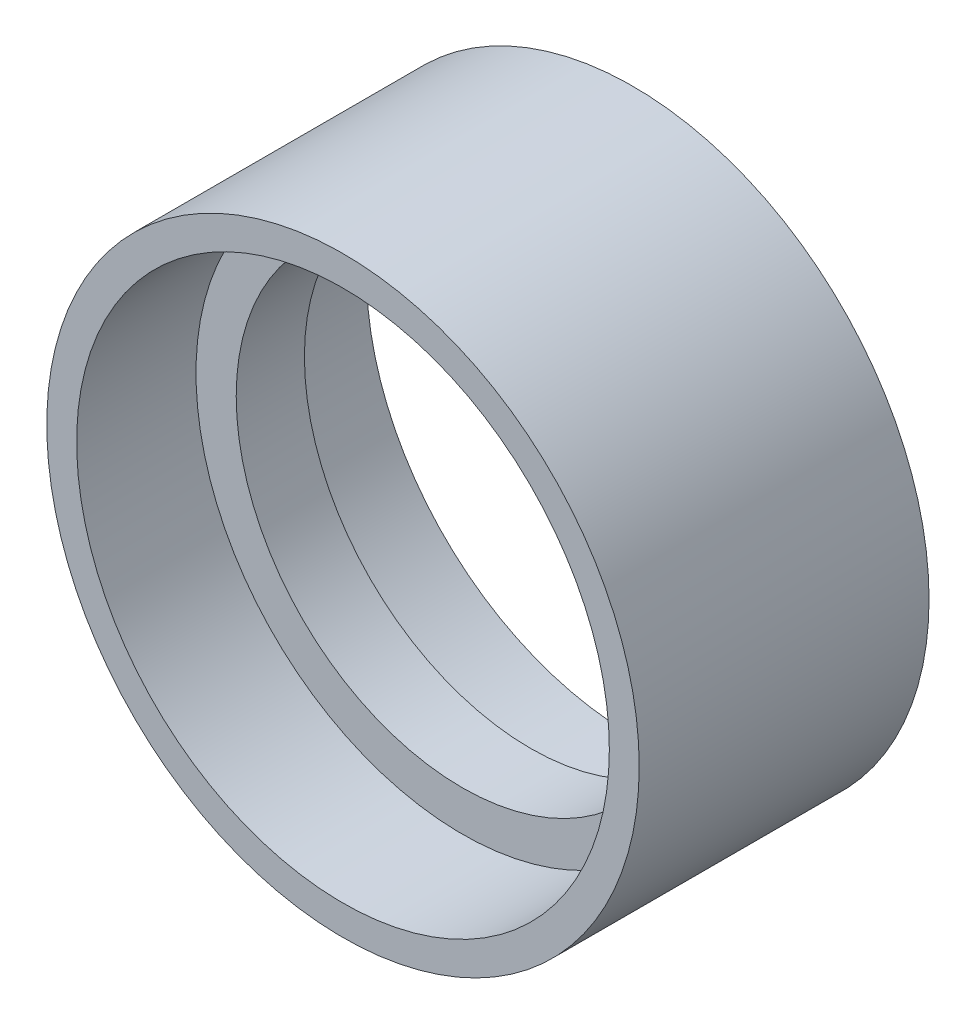
ISO-10303-21;
HEADER;
FILE_DESCRIPTION(('STEP AP214'),'2;1');
FILE_NAME('part.step','',(''),(''),'','','');
FILE_SCHEMA(('AUTOMOTIVE_DESIGN { 1 0 10303 214 1 1 1 1 }'));
ENDSEC;
DATA;
#1=APPLICATION_CONTEXT('core data for automotive mechanical design processes');
#2=APPLICATION_PROTOCOL_DEFINITION('international standard','automotive_design',2000,#1);
#3=PRODUCT_CONTEXT('',#1,'mechanical');
#4=PRODUCT('Part','Part','',(#3));
#5=PRODUCT_RELATED_PRODUCT_CATEGORY('part','',(#4));
#6=PRODUCT_DEFINITION_FORMATION('','',#4);
#7=PRODUCT_DEFINITION_CONTEXT('part definition',#1,'design');
#8=PRODUCT_DEFINITION('design','',#6,#7);
#9=PRODUCT_DEFINITION_SHAPE('','',#8);
#10=(LENGTH_UNIT() NAMED_UNIT(*) SI_UNIT(.MILLI.,.METRE.));
#11=(NAMED_UNIT(*) PLANE_ANGLE_UNIT() SI_UNIT($,.RADIAN.));
#12=(NAMED_UNIT(*) SI_UNIT($,.STERADIAN.) SOLID_ANGLE_UNIT());
#13=UNCERTAINTY_MEASURE_WITH_UNIT(LENGTH_MEASURE(1.E-05),#10,'distance_accuracy_value','');
#14=(GEOMETRIC_REPRESENTATION_CONTEXT(3) GLOBAL_UNCERTAINTY_ASSIGNED_CONTEXT((#13)) GLOBAL_UNIT_ASSIGNED_CONTEXT((#10,
#11,#12)) REPRESENTATION_CONTEXT('',''));
#15=CARTESIAN_POINT('',(0.,0.,0.));
#16=DIRECTION('',(0.,0.,1.));
#17=DIRECTION('',(1.,0.,0.));
#18=AXIS2_PLACEMENT_3D('',#15,#16,#17);
#19=CARTESIAN_POINT('',(0.,0.,-16.));
#20=DIRECTION('',(0.,0.,1.));
#21=DIRECTION('',(1.,0.,0.));
#22=AXIS2_PLACEMENT_3D('',#19,#20,#21);
#23=PLANE('',#22);
#24=CARTESIAN_POINT('',(0.,-66.,-16.));
#25=DIRECTION('',(0.,0.,1.));
#26=DIRECTION('',(1.,0.,0.));
#27=AXIS2_PLACEMENT_3D('',#24,#25,#26);
#28=CIRCLE('',#27,1.25);
#29=CARTESIAN_POINT('',(1.24999999999998,-66.,-16.));
#30=VERTEX_POINT('',#29);
#31=EDGE_CURVE('E11',#30,#30,#28,.T.);
#32=ORIENTED_EDGE('',*,*,#31,.F.);
#33=EDGE_LOOP('',(#32));
#34=FACE_BOUND('',#33,.T.);
#35=ADVANCED_FACE('F16',(#34),#23,.F.);
#36=CARTESIAN_POINT('',(0.,-66.,-16.));
#37=DIRECTION('',(0.,0.,-1.));
#38=DIRECTION('',(-1.,0.,0.));
#39=AXIS2_PLACEMENT_3D('',#36,#37,#38);
#40=CYLINDRICAL_SURFACE('',#39,1.25);
#41=CARTESIAN_POINT('',(0.,-66.,-34.));
#42=DIRECTION('',(0.,0.,1.));
#43=DIRECTION('',(1.,0.,0.));
#44=AXIS2_PLACEMENT_3D('',#41,#42,#43);
#45=CIRCLE('',#44,1.25);
#46=CARTESIAN_POINT('',(1.24999999999998,-66.,-34.));
#47=VERTEX_POINT('',#46);
#48=EDGE_CURVE('E238',#47,#47,#45,.T.);
#49=ORIENTED_EDGE('',*,*,#48,.F.);
#50=EDGE_LOOP('',(#49));
#51=FACE_BOUND('',#50,.T.);
#52=ORIENTED_EDGE('',*,*,#31,.T.);
#53=EDGE_LOOP('',(#52));
#54=FACE_BOUND('',#53,.T.);
#55=ADVANCED_FACE('F366',(#51,#54),#40,.F.);
#56=CARTESIAN_POINT('',(0.,0.,-16.));
#57=DIRECTION('',(0.,0.,1.));
#58=DIRECTION('',(1.,0.,0.));
#59=AXIS2_PLACEMENT_3D('',#56,#57,#58);
#60=PLANE('',#59);
#61=CARTESIAN_POINT('',(22.5733294594941,-62.0197129718699,-16.));
#62=DIRECTION('',(0.,0.,1.));
#63=DIRECTION('',(1.,0.,0.));
#64=AXIS2_PLACEMENT_3D('',#61,#62,#63);
#65=CIRCLE('',#64,1.25);
#66=CARTESIAN_POINT('',(23.8233294594941,-62.0197129718699,-16.));
#67=VERTEX_POINT('',#66);
#68=EDGE_CURVE('E27',#67,#67,#65,.T.);
#69=ORIENTED_EDGE('',*,*,#68,.F.);
#70=EDGE_LOOP('',(#69));
#71=FACE_BOUND('',#70,.T.);
#72=ADVANCED_FACE('F371',(#71),#60,.F.);
#73=CARTESIAN_POINT('',(22.5733294594941,-62.0197129718699,-16.));
#74=DIRECTION('',(0.,0.,-1.));
#75=DIRECTION('',(-1.,0.,0.));
#76=AXIS2_PLACEMENT_3D('',#73,#74,#75);
#77=CYLINDRICAL_SURFACE('',#76,1.25);
#78=CARTESIAN_POINT('',(22.5733294594941,-62.0197129718699,-34.));
#79=DIRECTION('',(0.,0.,1.));
#80=DIRECTION('',(1.,0.,0.));
#81=AXIS2_PLACEMENT_3D('',#78,#79,#80);
#82=CIRCLE('',#81,1.25);
#83=CARTESIAN_POINT('',(23.8233294594941,-62.0197129718699,-34.));
#84=VERTEX_POINT('',#83);
#85=EDGE_CURVE('E232',#84,#84,#82,.T.);
#86=ORIENTED_EDGE('',*,*,#85,.F.);
#87=EDGE_LOOP('',(#86));
#88=FACE_BOUND('',#87,.T.);
#89=ORIENTED_EDGE('',*,*,#68,.T.);
#90=EDGE_LOOP('',(#89));
#91=FACE_BOUND('',#90,.T.);
#92=ADVANCED_FACE('F419',(#88,#91),#77,.F.);
#93=CARTESIAN_POINT('',(0.,0.,-16.));
#94=DIRECTION('',(0.,0.,1.));
#95=DIRECTION('',(1.,0.,0.));
#96=AXIS2_PLACEMENT_3D('',#93,#94,#95);
#97=PLANE('',#96);
#98=CARTESIAN_POINT('',(42.4239822393115,-50.5589332458526,-16.));
#99=DIRECTION('',(0.,0.,1.));
#100=DIRECTION('',(1.,0.,0.));
#101=AXIS2_PLACEMENT_3D('',#98,#99,#100);
#102=CIRCLE('',#101,1.25);
#103=CARTESIAN_POINT('',(43.6739822393115,-50.5589332458526,-16.));
#104=VERTEX_POINT('',#103);
#105=EDGE_CURVE('E259',#104,#104,#102,.T.);
#106=ORIENTED_EDGE('',*,*,#105,.F.);
#107=EDGE_LOOP('',(#106));
#108=FACE_BOUND('',#107,.T.);
#109=ADVANCED_FACE('F417',(#108),#97,.F.);
#110=CARTESIAN_POINT('',(42.4239822393115,-50.5589332458526,-16.));
#111=DIRECTION('',(0.,0.,-1.));
#112=DIRECTION('',(-1.,0.,0.));
#113=AXIS2_PLACEMENT_3D('',#110,#111,#112);
#114=CYLINDRICAL_SURFACE('',#113,1.25);
#115=CARTESIAN_POINT('',(42.4239822393115,-50.5589332458526,-34.));
#116=DIRECTION('',(0.,0.,1.));
#117=DIRECTION('',(1.,0.,0.));
#118=AXIS2_PLACEMENT_3D('',#115,#116,#117);
#119=CIRCLE('',#118,1.25);
#120=CARTESIAN_POINT('',(43.6739822393115,-50.5589332458526,-34.));
#121=VERTEX_POINT('',#120);
#122=EDGE_CURVE('E227',#121,#121,#119,.T.);
#123=ORIENTED_EDGE('',*,*,#122,.F.);
#124=EDGE_LOOP('',(#123));
#125=FACE_BOUND('',#124,.T.);
#126=ORIENTED_EDGE('',*,*,#105,.T.);
#127=EDGE_LOOP('',(#126));
#128=FACE_BOUND('',#127,.T.);
#129=ADVANCED_FACE('F18',(#125,#128),#114,.F.);
#130=CARTESIAN_POINT('',(0.,0.,-16.));
#131=DIRECTION('',(0.,0.,1.));
#132=DIRECTION('',(1.,0.,0.));
#133=AXIS2_PLACEMENT_3D('',#130,#131,#132);
#134=PLANE('',#133);
#135=CARTESIAN_POINT('',(64.9973116988057,-11.4607797260174,-16.));
#136=DIRECTION('',(0.,0.,1.));
#137=DIRECTION('',(1.,0.,0.));
#138=AXIS2_PLACEMENT_3D('',#135,#136,#137);
#139=CIRCLE('',#138,1.25);
#140=CARTESIAN_POINT('',(66.2473116988057,-11.4607797260174,-16.));
#141=VERTEX_POINT('',#140);
#142=EDGE_CURVE('E256',#141,#141,#139,.T.);
#143=ORIENTED_EDGE('',*,*,#142,.F.);
#144=EDGE_LOOP('',(#143));
#145=FACE_BOUND('',#144,.T.);
#146=ADVANCED_FACE('F696',(#145),#134,.F.);
#147=CARTESIAN_POINT('',(64.9973116988057,-11.4607797260174,-16.));
#148=DIRECTION('',(0.,0.,-1.));
#149=DIRECTION('',(-1.,0.,0.));
#150=AXIS2_PLACEMENT_3D('',#147,#148,#149);
#151=CYLINDRICAL_SURFACE('',#150,1.25);
#152=CARTESIAN_POINT('',(64.9973116988057,-11.4607797260174,-34.));
#153=DIRECTION('',(0.,0.,1.));
#154=DIRECTION('',(1.,0.,0.));
#155=AXIS2_PLACEMENT_3D('',#152,#153,#154);
#156=CIRCLE('',#155,1.25);
#157=CARTESIAN_POINT('',(66.2473116988057,-11.4607797260174,-34.));
#158=VERTEX_POINT('',#157);
#159=EDGE_CURVE('E217',#158,#158,#156,.T.);
#160=ORIENTED_EDGE('',*,*,#159,.F.);
#161=EDGE_LOOP('',(#160));
#162=FACE_BOUND('',#161,.T.);
#163=ORIENTED_EDGE('',*,*,#142,.T.);
#164=EDGE_LOOP('',(#163));
#165=FACE_BOUND('',#164,.T.);
#166=ADVANCED_FACE('F488',(#162,#165),#151,.F.);
#167=CARTESIAN_POINT('',(0.,0.,-16.));
#168=DIRECTION('',(0.,0.,1.));
#169=DIRECTION('',(1.,0.,0.));
#170=AXIS2_PLACEMENT_3D('',#167,#168,#169);
#171=PLANE('',#170);
#172=CARTESIAN_POINT('',(57.1576766497729,-33.,-16.));
#173=DIRECTION('',(0.,0.,1.));
#174=DIRECTION('',(1.,0.,0.));
#175=AXIS2_PLACEMENT_3D('',#172,#173,#174);
#176=CIRCLE('',#175,1.25);
#177=CARTESIAN_POINT('',(58.4076766497729,-33.,-16.));
#178=VERTEX_POINT('',#177);
#179=EDGE_CURVE('E260',#178,#178,#176,.T.);
#180=ORIENTED_EDGE('',*,*,#179,.F.);
#181=EDGE_LOOP('',(#180));
#182=FACE_BOUND('',#181,.T.);
#183=ADVANCED_FACE('F475',(#182),#171,.F.);
#184=CARTESIAN_POINT('',(57.1576766497729,-33.,-16.));
#185=DIRECTION('',(0.,0.,-1.));
#186=DIRECTION('',(-1.,0.,0.));
#187=AXIS2_PLACEMENT_3D('',#184,#185,#186);
#188=CYLINDRICAL_SURFACE('',#187,1.25);
#189=CARTESIAN_POINT('',(57.1576766497729,-33.,-34.));
#190=DIRECTION('',(0.,0.,1.));
#191=DIRECTION('',(1.,0.,0.));
#192=AXIS2_PLACEMENT_3D('',#189,#190,#191);
#193=CIRCLE('',#192,1.25);
#194=CARTESIAN_POINT('',(58.4076766497729,-33.,-34.));
#195=VERTEX_POINT('',#194);
#196=EDGE_CURVE('E211',#195,#195,#193,.T.);
#197=ORIENTED_EDGE('',*,*,#196,.F.);
#198=EDGE_LOOP('',(#197));
#199=FACE_BOUND('',#198,.T.);
#200=ORIENTED_EDGE('',*,*,#179,.T.);
#201=EDGE_LOOP('',(#200));
#202=FACE_BOUND('',#201,.T.);
#203=ADVANCED_FACE('F471',(#199,#202),#188,.F.);
#204=CARTESIAN_POINT('',(0.,0.,-16.));
#205=DIRECTION('',(0.,0.,1.));
#206=DIRECTION('',(1.,0.,0.));
#207=AXIS2_PLACEMENT_3D('',#204,#205,#206);
#208=PLANE('',#207);
#209=CARTESIAN_POINT('',(64.9973116988057,11.4607797260174,-16.));
#210=DIRECTION('',(0.,0.,1.));
#211=DIRECTION('',(1.,0.,0.));
#212=AXIS2_PLACEMENT_3D('',#209,#210,#211);
#213=CIRCLE('',#212,1.25);
#214=CARTESIAN_POINT('',(66.2473116988057,11.4607797260174,-16.));
#215=VERTEX_POINT('',#214);
#216=EDGE_CURVE('E254',#215,#215,#213,.T.);
#217=ORIENTED_EDGE('',*,*,#216,.F.);
#218=EDGE_LOOP('',(#217));
#219=FACE_BOUND('',#218,.T.);
#220=ADVANCED_FACE('F474',(#219),#208,.F.);
#221=CARTESIAN_POINT('',(64.9973116988057,11.4607797260174,-16.));
#222=DIRECTION('',(0.,0.,-1.));
#223=DIRECTION('',(-1.,0.,0.));
#224=AXIS2_PLACEMENT_3D('',#221,#222,#223);
#225=CYLINDRICAL_SURFACE('',#224,1.25);
#226=CARTESIAN_POINT('',(64.9973116988057,11.4607797260174,-34.));
#227=DIRECTION('',(0.,0.,1.));
#228=DIRECTION('',(1.,0.,0.));
#229=AXIS2_PLACEMENT_3D('',#226,#227,#228);
#230=CIRCLE('',#229,1.25);
#231=CARTESIAN_POINT('',(66.2473116988057,11.4607797260174,-34.));
#232=VERTEX_POINT('',#231);
#233=EDGE_CURVE('E216',#232,#232,#230,.T.);
#234=ORIENTED_EDGE('',*,*,#233,.F.);
#235=EDGE_LOOP('',(#234));
#236=FACE_BOUND('',#235,.T.);
#237=ORIENTED_EDGE('',*,*,#216,.T.);
#238=EDGE_LOOP('',(#237));
#239=FACE_BOUND('',#238,.T.);
#240=ADVANCED_FACE('F411',(#236,#239),#225,.F.);
#241=CARTESIAN_POINT('',(0.,0.,-16.));
#242=DIRECTION('',(0.,0.,1.));
#243=DIRECTION('',(1.,0.,0.));
#244=AXIS2_PLACEMENT_3D('',#241,#242,#243);
#245=PLANE('',#244);
#246=CARTESIAN_POINT('',(57.157676649773,33.,-16.));
#247=DIRECTION('',(0.,0.,1.));
#248=DIRECTION('',(1.,0.,0.));
#249=AXIS2_PLACEMENT_3D('',#246,#247,#248);
#250=CIRCLE('',#249,1.25);
#251=CARTESIAN_POINT('',(58.407676649773,33.,-16.));
#252=VERTEX_POINT('',#251);
#253=EDGE_CURVE('E251',#252,#252,#250,.T.);
#254=ORIENTED_EDGE('',*,*,#253,.F.);
#255=EDGE_LOOP('',(#254));
#256=FACE_BOUND('',#255,.T.);
#257=ADVANCED_FACE('F407',(#256),#245,.F.);
#258=CARTESIAN_POINT('',(57.157676649773,33.,-16.));
#259=DIRECTION('',(0.,0.,-1.));
#260=DIRECTION('',(-1.,0.,0.));
#261=AXIS2_PLACEMENT_3D('',#258,#259,#260);
#262=CYLINDRICAL_SURFACE('',#261,1.25);
#263=CARTESIAN_POINT('',(57.157676649773,33.,-34.));
#264=DIRECTION('',(0.,0.,1.));
#265=DIRECTION('',(1.,0.,0.));
#266=AXIS2_PLACEMENT_3D('',#263,#264,#265);
#267=CIRCLE('',#266,1.25);
#268=CARTESIAN_POINT('',(58.407676649773,33.,-34.));
#269=VERTEX_POINT('',#268);
#270=EDGE_CURVE('E224',#269,#269,#267,.T.);
#271=ORIENTED_EDGE('',*,*,#270,.F.);
#272=EDGE_LOOP('',(#271));
#273=FACE_BOUND('',#272,.T.);
#274=ORIENTED_EDGE('',*,*,#253,.T.);
#275=EDGE_LOOP('',(#274));
#276=FACE_BOUND('',#275,.T.);
#277=ADVANCED_FACE('F410',(#273,#276),#262,.F.);
#278=CARTESIAN_POINT('',(0.,0.,-16.));
#279=DIRECTION('',(0.,0.,1.));
#280=DIRECTION('',(1.,0.,0.));
#281=AXIS2_PLACEMENT_3D('',#278,#279,#280);
#282=PLANE('',#281);
#283=CARTESIAN_POINT('',(42.4239822393116,50.5589332458525,-16.));
#284=DIRECTION('',(0.,0.,1.));
#285=DIRECTION('',(1.,0.,0.));
#286=AXIS2_PLACEMENT_3D('',#283,#284,#285);
#287=CIRCLE('',#286,1.25);
#288=CARTESIAN_POINT('',(43.6739822393116,50.5589332458525,-16.));
#289=VERTEX_POINT('',#288);
#290=EDGE_CURVE('E255',#289,#289,#287,.T.);
#291=ORIENTED_EDGE('',*,*,#290,.F.);
#292=EDGE_LOOP('',(#291));
#293=FACE_BOUND('',#292,.T.);
#294=ADVANCED_FACE('F464',(#293),#282,.F.);
#295=CARTESIAN_POINT('',(42.4239822393116,50.5589332458525,-16.));
#296=DIRECTION('',(0.,0.,-1.));
#297=DIRECTION('',(-1.,0.,0.));
#298=AXIS2_PLACEMENT_3D('',#295,#296,#297);
#299=CYLINDRICAL_SURFACE('',#298,1.25);
#300=CARTESIAN_POINT('',(42.4239822393116,50.5589332458525,-34.));
#301=DIRECTION('',(0.,0.,1.));
#302=DIRECTION('',(1.,0.,0.));
#303=AXIS2_PLACEMENT_3D('',#300,#301,#302);
#304=CIRCLE('',#303,1.25);
#305=CARTESIAN_POINT('',(43.6739822393116,50.5589332458525,-34.));
#306=VERTEX_POINT('',#305);
#307=EDGE_CURVE('E245',#306,#306,#304,.T.);
#308=ORIENTED_EDGE('',*,*,#307,.F.);
#309=EDGE_LOOP('',(#308));
#310=FACE_BOUND('',#309,.T.);
#311=ORIENTED_EDGE('',*,*,#290,.T.);
#312=EDGE_LOOP('',(#311));
#313=FACE_BOUND('',#312,.T.);
#314=ADVANCED_FACE('F405',(#310,#313),#299,.F.);
#315=CARTESIAN_POINT('',(0.,0.,-16.));
#316=DIRECTION('',(0.,0.,1.));
#317=DIRECTION('',(1.,0.,0.));
#318=AXIS2_PLACEMENT_3D('',#315,#316,#317);
#319=PLANE('',#318);
#320=CARTESIAN_POINT('',(-22.5733294594942,-62.01971297187,-16.));
#321=DIRECTION('',(0.,0.,1.));
#322=DIRECTION('',(1.,0.,0.));
#323=AXIS2_PLACEMENT_3D('',#320,#321,#322);
#324=CIRCLE('',#323,1.25);
#325=CARTESIAN_POINT('',(-21.3233294594941,-62.01971297187,-16.));
#326=VERTEX_POINT('',#325);
#327=EDGE_CURVE('E249',#326,#326,#324,.T.);
#328=ORIENTED_EDGE('',*,*,#327,.F.);
#329=EDGE_LOOP('',(#328));
#330=FACE_BOUND('',#329,.T.);
#331=ADVANCED_FACE('F402',(#330),#319,.F.);
#332=CARTESIAN_POINT('',(-22.5733294594942,-62.01971297187,-16.));
#333=DIRECTION('',(0.,0.,-1.));
#334=DIRECTION('',(-1.,0.,0.));
#335=AXIS2_PLACEMENT_3D('',#332,#333,#334);
#336=CYLINDRICAL_SURFACE('',#335,1.25);
#337=CARTESIAN_POINT('',(-22.5733294594942,-62.01971297187,-34.));
#338=DIRECTION('',(0.,0.,1.));
#339=DIRECTION('',(1.,0.,0.));
#340=AXIS2_PLACEMENT_3D('',#337,#338,#339);
#341=CIRCLE('',#340,1.25);
#342=CARTESIAN_POINT('',(-21.3233294594941,-62.01971297187,-34.));
#343=VERTEX_POINT('',#342);
#344=EDGE_CURVE('E292',#343,#343,#341,.T.);
#345=ORIENTED_EDGE('',*,*,#344,.F.);
#346=EDGE_LOOP('',(#345));
#347=FACE_BOUND('',#346,.T.);
#348=ORIENTED_EDGE('',*,*,#327,.T.);
#349=EDGE_LOOP('',(#348));
#350=FACE_BOUND('',#349,.T.);
#351=ADVANCED_FACE('F381',(#347,#350),#336,.F.);
#352=CARTESIAN_POINT('',(0.,0.,-16.));
#353=DIRECTION('',(0.,0.,1.));
#354=DIRECTION('',(1.,0.,0.));
#355=AXIS2_PLACEMENT_3D('',#352,#353,#354);
#356=PLANE('',#355);
#357=CARTESIAN_POINT('',(-42.4239822393116,50.5589332458526,-16.));
#358=DIRECTION('',(0.,0.,1.));
#359=DIRECTION('',(1.,0.,0.));
#360=AXIS2_PLACEMENT_3D('',#357,#358,#359);
#361=CIRCLE('',#360,1.25);
#362=CARTESIAN_POINT('',(-41.1739822393116,50.5589332458526,-16.));
#363=VERTEX_POINT('',#362);
#364=EDGE_CURVE('E246',#363,#363,#361,.T.);
#365=ORIENTED_EDGE('',*,*,#364,.F.);
#366=EDGE_LOOP('',(#365));
#367=FACE_BOUND('',#366,.T.);
#368=ADVANCED_FACE('F377',(#367),#356,.F.);
#369=CARTESIAN_POINT('',(-42.4239822393116,50.5589332458526,-16.));
#370=DIRECTION('',(0.,0.,-1.));
#371=DIRECTION('',(-1.,0.,0.));
#372=AXIS2_PLACEMENT_3D('',#369,#370,#371);
#373=CYLINDRICAL_SURFACE('',#372,1.25);
#374=CARTESIAN_POINT('',(-42.4239822393116,50.5589332458526,-34.));
#375=DIRECTION('',(0.,0.,1.));
#376=DIRECTION('',(1.,0.,0.));
#377=AXIS2_PLACEMENT_3D('',#374,#375,#376);
#378=CIRCLE('',#377,1.25);
#379=CARTESIAN_POINT('',(-41.1739822393116,50.5589332458526,-34.));
#380=VERTEX_POINT('',#379);
#381=EDGE_CURVE('E289',#380,#380,#378,.T.);
#382=ORIENTED_EDGE('',*,*,#381,.F.);
#383=EDGE_LOOP('',(#382));
#384=FACE_BOUND('',#383,.T.);
#385=ORIENTED_EDGE('',*,*,#364,.T.);
#386=EDGE_LOOP('',(#385));
#387=FACE_BOUND('',#386,.T.);
#388=ADVANCED_FACE('F380',(#384,#387),#373,.F.);
#389=CARTESIAN_POINT('',(0.,0.,-16.));
#390=DIRECTION('',(0.,0.,1.));
#391=DIRECTION('',(1.,0.,0.));
#392=AXIS2_PLACEMENT_3D('',#389,#390,#391);
#393=PLANE('',#392);
#394=CARTESIAN_POINT('',(-57.157676649773,33.,-16.));
#395=DIRECTION('',(0.,0.,1.));
#396=DIRECTION('',(1.,0.,0.));
#397=AXIS2_PLACEMENT_3D('',#394,#395,#396);
#398=CIRCLE('',#397,1.25);
#399=CARTESIAN_POINT('',(-55.907676649773,33.,-16.));
#400=VERTEX_POINT('',#399);
#401=EDGE_CURVE('E250',#400,#400,#398,.T.);
#402=ORIENTED_EDGE('',*,*,#401,.F.);
#403=EDGE_LOOP('',(#402));
#404=FACE_BOUND('',#403,.T.);
#405=ADVANCED_FACE('F387',(#404),#393,.F.);
#406=CARTESIAN_POINT('',(-57.157676649773,33.,-16.));
#407=DIRECTION('',(0.,0.,-1.));
#408=DIRECTION('',(-1.,0.,0.));
#409=AXIS2_PLACEMENT_3D('',#406,#407,#408);
#410=CYLINDRICAL_SURFACE('',#409,1.25);
#411=CARTESIAN_POINT('',(-57.157676649773,33.,-34.));
#412=DIRECTION('',(0.,0.,1.));
#413=DIRECTION('',(1.,0.,0.));
#414=AXIS2_PLACEMENT_3D('',#411,#412,#413);
#415=CIRCLE('',#414,1.25);
#416=CARTESIAN_POINT('',(-55.907676649773,33.,-34.));
#417=VERTEX_POINT('',#416);
#418=EDGE_CURVE('E20',#417,#417,#415,.T.);
#419=ORIENTED_EDGE('',*,*,#418,.F.);
#420=EDGE_LOOP('',(#419));
#421=FACE_BOUND('',#420,.T.);
#422=ORIENTED_EDGE('',*,*,#401,.T.);
#423=EDGE_LOOP('',(#422));
#424=FACE_BOUND('',#423,.T.);
#425=ADVANCED_FACE('F383',(#421,#424),#410,.F.);
#426=CARTESIAN_POINT('',(0.,0.,-16.));
#427=DIRECTION('',(0.,0.,1.));
#428=DIRECTION('',(1.,0.,0.));
#429=AXIS2_PLACEMENT_3D('',#426,#427,#428);
#430=PLANE('',#429);
#431=CARTESIAN_POINT('',(-64.9973116988057,11.4607797260174,-16.));
#432=DIRECTION('',(0.,0.,1.));
#433=DIRECTION('',(1.,0.,0.));
#434=AXIS2_PLACEMENT_3D('',#431,#432,#433);
#435=CIRCLE('',#434,1.25);
#436=CARTESIAN_POINT('',(-63.7473116988057,11.4607797260174,-16.));
#437=VERTEX_POINT('',#436);
#438=EDGE_CURVE('E280',#437,#437,#435,.T.);
#439=ORIENTED_EDGE('',*,*,#438,.F.);
#440=EDGE_LOOP('',(#439));
#441=FACE_BOUND('',#440,.T.);
#442=ADVANCED_FACE('F386',(#441),#430,.F.);
#443=CARTESIAN_POINT('',(-64.9973116988057,11.4607797260174,-16.));
#444=DIRECTION('',(0.,0.,-1.));
#445=DIRECTION('',(-1.,0.,0.));
#446=AXIS2_PLACEMENT_3D('',#443,#444,#445);
#447=CYLINDRICAL_SURFACE('',#446,1.25);
#448=CARTESIAN_POINT('',(-64.9973116988057,11.4607797260174,-34.));
#449=DIRECTION('',(0.,0.,1.));
#450=DIRECTION('',(1.,0.,0.));
#451=AXIS2_PLACEMENT_3D('',#448,#449,#450);
#452=CIRCLE('',#451,1.25);
#453=CARTESIAN_POINT('',(-63.7473116988057,11.4607797260174,-34.));
#454=VERTEX_POINT('',#453);
#455=EDGE_CURVE('E295',#454,#454,#452,.T.);
#456=ORIENTED_EDGE('',*,*,#455,.F.);
#457=EDGE_LOOP('',(#456));
#458=FACE_BOUND('',#457,.T.);
#459=ORIENTED_EDGE('',*,*,#438,.T.);
#460=EDGE_LOOP('',(#459));
#461=FACE_BOUND('',#460,.T.);
#462=ADVANCED_FACE('F469',(#458,#461),#447,.F.);
#463=CARTESIAN_POINT('',(0.,0.,-16.));
#464=DIRECTION('',(0.,0.,1.));
#465=DIRECTION('',(1.,0.,0.));
#466=AXIS2_PLACEMENT_3D('',#463,#464,#465);
#467=PLANE('',#466);
#468=CARTESIAN_POINT('',(-57.157676649773,-33.,-16.));
#469=DIRECTION('',(0.,0.,1.));
#470=DIRECTION('',(1.,0.,0.));
#471=AXIS2_PLACEMENT_3D('',#468,#469,#470);
#472=CIRCLE('',#471,1.25);
#473=CARTESIAN_POINT('',(-55.907676649773,-33.,-16.));
#474=VERTEX_POINT('',#473);
#475=EDGE_CURVE('E315',#474,#474,#472,.T.);
#476=ORIENTED_EDGE('',*,*,#475,.F.);
#477=EDGE_LOOP('',(#476));
#478=FACE_BOUND('',#477,.T.);
#479=ADVANCED_FACE('F466',(#478),#467,.F.);
#480=CARTESIAN_POINT('',(-57.157676649773,-33.,-16.));
#481=DIRECTION('',(0.,0.,-1.));
#482=DIRECTION('',(-1.,0.,0.));
#483=AXIS2_PLACEMENT_3D('',#480,#481,#482);
#484=CYLINDRICAL_SURFACE('',#483,1.25);
#485=CARTESIAN_POINT('',(-57.157676649773,-33.,-34.));
#486=DIRECTION('',(0.,0.,1.));
#487=DIRECTION('',(1.,0.,0.));
#488=AXIS2_PLACEMENT_3D('',#485,#486,#487);
#489=CIRCLE('',#488,1.25);
#490=CARTESIAN_POINT('',(-55.907676649773,-33.,-34.));
#491=VERTEX_POINT('',#490);
#492=EDGE_CURVE('E298',#491,#491,#489,.T.);
#493=ORIENTED_EDGE('',*,*,#492,.F.);
#494=EDGE_LOOP('',(#493));
#495=FACE_BOUND('',#494,.T.);
#496=ORIENTED_EDGE('',*,*,#475,.T.);
#497=EDGE_LOOP('',(#496));
#498=FACE_BOUND('',#497,.T.);
#499=ADVANCED_FACE('F400',(#495,#498),#484,.F.);
#500=CARTESIAN_POINT('',(0.,0.,-16.));
#501=DIRECTION('',(0.,0.,1.));
#502=DIRECTION('',(1.,0.,0.));
#503=AXIS2_PLACEMENT_3D('',#500,#501,#502);
#504=PLANE('',#503);
#505=CARTESIAN_POINT('',(-42.4239822393117,-50.5589332458525,-16.));
#506=DIRECTION('',(0.,0.,1.));
#507=DIRECTION('',(1.,0.,0.));
#508=AXIS2_PLACEMENT_3D('',#505,#506,#507);
#509=CIRCLE('',#508,1.25);
#510=CARTESIAN_POINT('',(-41.1739822393117,-50.5589332458525,-16.));
#511=VERTEX_POINT('',#510);
#512=EDGE_CURVE('E285',#511,#511,#509,.T.);
#513=ORIENTED_EDGE('',*,*,#512,.F.);
#514=EDGE_LOOP('',(#513));
#515=FACE_BOUND('',#514,.T.);
#516=ADVANCED_FACE('F360',(#515),#504,.F.);
#517=CARTESIAN_POINT('',(-42.4239822393117,-50.5589332458525,-16.));
#518=DIRECTION('',(0.,0.,-1.));
#519=DIRECTION('',(-1.,0.,0.));
#520=AXIS2_PLACEMENT_3D('',#517,#518,#519);
#521=CYLINDRICAL_SURFACE('',#520,1.25);
#522=CARTESIAN_POINT('',(-42.4239822393117,-50.5589332458525,-34.));
#523=DIRECTION('',(0.,0.,1.));
#524=DIRECTION('',(1.,0.,0.));
#525=AXIS2_PLACEMENT_3D('',#522,#523,#524);
#526=CIRCLE('',#525,1.25);
#527=CARTESIAN_POINT('',(-41.1739822393117,-50.5589332458525,-34.));
#528=VERTEX_POINT('',#527);
#529=EDGE_CURVE('E305',#528,#528,#526,.T.);
#530=ORIENTED_EDGE('',*,*,#529,.F.);
#531=EDGE_LOOP('',(#530));
#532=FACE_BOUND('',#531,.T.);
#533=ORIENTED_EDGE('',*,*,#512,.T.);
#534=EDGE_LOOP('',(#533));
#535=FACE_BOUND('',#534,.T.);
#536=ADVANCED_FACE('F355',(#532,#535),#521,.F.);
#537=CARTESIAN_POINT('',(0.,0.,-16.));
#538=DIRECTION('',(0.,0.,1.));
#539=DIRECTION('',(1.,0.,0.));
#540=AXIS2_PLACEMENT_3D('',#537,#538,#539);
#541=PLANE('',#540);
#542=CARTESIAN_POINT('',(-64.9973116988057,-11.4607797260174,-16.));
#543=DIRECTION('',(0.,0.,1.));
#544=DIRECTION('',(1.,0.,0.));
#545=AXIS2_PLACEMENT_3D('',#542,#543,#544);
#546=CIRCLE('',#545,1.25);
#547=CARTESIAN_POINT('',(-63.7473116988057,-11.4607797260174,-16.));
#548=VERTEX_POINT('',#547);
#549=EDGE_CURVE('E273',#548,#548,#546,.T.);
#550=ORIENTED_EDGE('',*,*,#549,.F.);
#551=EDGE_LOOP('',(#550));
#552=FACE_BOUND('',#551,.T.);
#553=ADVANCED_FACE('F350',(#552),#541,.F.);
#554=CARTESIAN_POINT('',(-64.9973116988057,-11.4607797260174,-16.));
#555=DIRECTION('',(0.,0.,-1.));
#556=DIRECTION('',(-1.,0.,0.));
#557=AXIS2_PLACEMENT_3D('',#554,#555,#556);
#558=CYLINDRICAL_SURFACE('',#557,1.25);
#559=CARTESIAN_POINT('',(-64.9973116988057,-11.4607797260174,-34.));
#560=DIRECTION('',(0.,0.,1.));
#561=DIRECTION('',(1.,0.,0.));
#562=AXIS2_PLACEMENT_3D('',#559,#560,#561);
#563=CIRCLE('',#562,1.25);
#564=CARTESIAN_POINT('',(-63.7473116988057,-11.4607797260174,-34.));
#565=VERTEX_POINT('',#564);
#566=EDGE_CURVE('E308',#565,#565,#563,.T.);
#567=ORIENTED_EDGE('',*,*,#566,.F.);
#568=EDGE_LOOP('',(#567));
#569=FACE_BOUND('',#568,.T.);
#570=ORIENTED_EDGE('',*,*,#549,.T.);
#571=EDGE_LOOP('',(#570));
#572=FACE_BOUND('',#571,.T.);
#573=ADVANCED_FACE('F346',(#569,#572),#558,.F.);
#574=CARTESIAN_POINT('',(0.,0.,-16.));
#575=DIRECTION('',(0.,0.,1.));
#576=DIRECTION('',(1.,0.,0.));
#577=AXIS2_PLACEMENT_3D('',#574,#575,#576);
#578=PLANE('',#577);
#579=CARTESIAN_POINT('',(0.,66.,-16.));
#580=DIRECTION('',(0.,0.,1.));
#581=DIRECTION('',(1.,0.,0.));
#582=AXIS2_PLACEMENT_3D('',#579,#580,#581);
#583=CIRCLE('',#582,1.25);
#584=CARTESIAN_POINT('',(1.25,66.,-16.));
#585=VERTEX_POINT('',#584);
#586=EDGE_CURVE('E262',#585,#585,#583,.T.);
#587=ORIENTED_EDGE('',*,*,#586,.F.);
#588=EDGE_LOOP('',(#587));
#589=FACE_BOUND('',#588,.T.);
#590=ADVANCED_FACE('F349',(#589),#578,.F.);
#591=CARTESIAN_POINT('',(0.,66.,-16.));
#592=DIRECTION('',(0.,0.,-1.));
#593=DIRECTION('',(-1.,0.,0.));
#594=AXIS2_PLACEMENT_3D('',#591,#592,#593);
#595=CYLINDRICAL_SURFACE('',#594,1.25);
#596=CARTESIAN_POINT('',(0.,66.,-34.));
#597=DIRECTION('',(0.,0.,1.));
#598=DIRECTION('',(1.,0.,0.));
#599=AXIS2_PLACEMENT_3D('',#596,#597,#598);
#600=CIRCLE('',#599,1.25);
#601=CARTESIAN_POINT('',(1.25,66.,-34.));
#602=VERTEX_POINT('',#601);
#603=EDGE_CURVE('E318',#602,#602,#600,.T.);
#604=ORIENTED_EDGE('',*,*,#603,.F.);
#605=EDGE_LOOP('',(#604));
#606=FACE_BOUND('',#605,.T.);
#607=ORIENTED_EDGE('',*,*,#586,.T.);
#608=EDGE_LOOP('',(#607));
#609=FACE_BOUND('',#608,.T.);
#610=ADVANCED_FACE('F432',(#606,#609),#595,.F.);
#611=CARTESIAN_POINT('',(0.,0.,-16.));
#612=DIRECTION('',(0.,0.,1.));
#613=DIRECTION('',(1.,0.,0.));
#614=AXIS2_PLACEMENT_3D('',#611,#612,#613);
#615=PLANE('',#614);
#616=CARTESIAN_POINT('',(22.5733294594942,62.01971297187,-16.));
#617=DIRECTION('',(0.,0.,1.));
#618=DIRECTION('',(1.,0.,0.));
#619=AXIS2_PLACEMENT_3D('',#616,#617,#618);
#620=CIRCLE('',#619,1.25);
#621=CARTESIAN_POINT('',(23.8233294594942,62.01971297187,-16.));
#622=VERTEX_POINT('',#621);
#623=EDGE_CURVE('E261',#622,#622,#620,.T.);
#624=ORIENTED_EDGE('',*,*,#623,.F.);
#625=EDGE_LOOP('',(#624));
#626=FACE_BOUND('',#625,.T.);
#627=ADVANCED_FACE('F424',(#626),#615,.F.);
#628=CARTESIAN_POINT('',(22.5733294594942,62.01971297187,-16.));
#629=DIRECTION('',(0.,0.,-1.));
#630=DIRECTION('',(-1.,0.,0.));
#631=AXIS2_PLACEMENT_3D('',#628,#629,#630);
#632=CYLINDRICAL_SURFACE('',#631,1.25);
#633=CARTESIAN_POINT('',(22.5733294594942,62.01971297187,-34.));
#634=DIRECTION('',(0.,0.,1.));
#635=DIRECTION('',(1.,0.,0.));
#636=AXIS2_PLACEMENT_3D('',#633,#634,#635);
#637=CIRCLE('',#636,1.25);
#638=CARTESIAN_POINT('',(23.8233294594942,62.01971297187,-34.));
#639=VERTEX_POINT('',#638);
#640=EDGE_CURVE('E321',#639,#639,#637,.T.);
#641=ORIENTED_EDGE('',*,*,#640,.F.);
#642=EDGE_LOOP('',(#641));
#643=FACE_BOUND('',#642,.T.);
#644=ORIENTED_EDGE('',*,*,#623,.T.);
#645=EDGE_LOOP('',(#644));
#646=FACE_BOUND('',#645,.T.);
#647=ADVANCED_FACE('F421',(#643,#646),#632,.F.);
#648=CARTESIAN_POINT('',(0.,0.,-16.));
#649=DIRECTION('',(0.,0.,1.));
#650=DIRECTION('',(1.,0.,0.));
#651=AXIS2_PLACEMENT_3D('',#648,#649,#650);
#652=PLANE('',#651);
#653=CARTESIAN_POINT('',(-22.5733294594942,62.01971297187,-16.));
#654=DIRECTION('',(0.,0.,1.));
#655=DIRECTION('',(1.,0.,0.));
#656=AXIS2_PLACEMENT_3D('',#653,#654,#655);
#657=CIRCLE('',#656,1.25);
#658=CARTESIAN_POINT('',(-21.3233294594941,62.01971297187,-16.));
#659=VERTEX_POINT('',#658);
#660=EDGE_CURVE('E236',#659,#659,#657,.T.);
#661=ORIENTED_EDGE('',*,*,#660,.F.);
#662=EDGE_LOOP('',(#661));
#663=FACE_BOUND('',#662,.T.);
#664=ADVANCED_FACE('F423',(#663),#652,.F.);
#665=CARTESIAN_POINT('',(-22.5733294594942,62.01971297187,-16.));
#666=DIRECTION('',(0.,0.,-1.));
#667=DIRECTION('',(-1.,0.,0.));
#668=AXIS2_PLACEMENT_3D('',#665,#666,#667);
#669=CYLINDRICAL_SURFACE('',#668,1.25);
#670=CARTESIAN_POINT('',(-22.5733294594942,62.01971297187,-34.));
#671=DIRECTION('',(0.,0.,1.));
#672=DIRECTION('',(1.,0.,0.));
#673=AXIS2_PLACEMENT_3D('',#670,#671,#672);
#674=CIRCLE('',#673,1.25);
#675=CARTESIAN_POINT('',(-21.3233294594941,62.01971297187,-34.));
#676=VERTEX_POINT('',#675);
#677=EDGE_CURVE('E277',#676,#676,#674,.T.);
#678=ORIENTED_EDGE('',*,*,#677,.F.);
#679=EDGE_LOOP('',(#678));
#680=FACE_BOUND('',#679,.T.);
#681=ORIENTED_EDGE('',*,*,#660,.T.);
#682=EDGE_LOOP('',(#681));
#683=FACE_BOUND('',#682,.T.);
#684=ADVANCED_FACE('F429',(#680,#683),#669,.F.);
#685=CARTESIAN_POINT('',(0.,0.,-10.));
#686=DIRECTION('',(0.,0.,1.));
#687=DIRECTION('',(1.,0.,0.));
#688=AXIS2_PLACEMENT_3D('',#685,#686,#687);
#689=PLANE('',#688);
#690=CARTESIAN_POINT('',(0.,0.,-10.));
#691=DIRECTION('',(0.,0.,1.));
#692=DIRECTION('',(1.,0.,0.));
#693=AXIS2_PLACEMENT_3D('',#690,#691,#692);
#694=CIRCLE('',#693,62.49);
#695=CARTESIAN_POINT('',(62.49,0.,-10.));
#696=VERTEX_POINT('',#695);
#697=EDGE_CURVE('E264',#696,#696,#694,.T.);
#698=ORIENTED_EDGE('',*,*,#697,.F.);
#699=EDGE_LOOP('',(#698));
#700=FACE_BOUND('',#699,.T.);
#701=CARTESIAN_POINT('',(0.,0.,-10.));
#702=DIRECTION('',(0.,0.,1.));
#703=DIRECTION('',(1.,0.,0.));
#704=AXIS2_PLACEMENT_3D('',#701,#702,#703);
#705=CIRCLE('',#704,53.05461);
#706=CARTESIAN_POINT('',(53.05461,0.,-10.));
#707=VERTEX_POINT('',#706);
#708=EDGE_CURVE('E234',#707,#707,#705,.T.);
#709=ORIENTED_EDGE('',*,*,#708,.T.);
#710=EDGE_LOOP('',(#709));
#711=FACE_BOUND('',#710,.T.);
#712=ADVANCED_FACE('F396',(#700,#711),#689,.F.);
#713=CARTESIAN_POINT('',(0.,0.,6.));
#714=DIRECTION('',(0.,0.,1.));
#715=DIRECTION('',(1.,0.,0.));
#716=AXIS2_PLACEMENT_3D('',#713,#714,#715);
#717=PLANE('',#716);
#718=CARTESIAN_POINT('',(0.,0.,6.));
#719=DIRECTION('',(0.,0.,1.));
#720=DIRECTION('',(1.,0.,0.));
#721=AXIS2_PLACEMENT_3D('',#718,#719,#720);
#722=CIRCLE('',#721,62.49);
#723=CARTESIAN_POINT('',(62.49,0.,6.));
#724=VERTEX_POINT('',#723);
#725=EDGE_CURVE('E267',#724,#724,#722,.T.);
#726=ORIENTED_EDGE('',*,*,#725,.T.);
#727=EDGE_LOOP('',(#726));
#728=FACE_BOUND('',#727,.T.);
#729=CARTESIAN_POINT('',(0.,0.,6.));
#730=DIRECTION('',(0.,0.,1.));
#731=DIRECTION('',(1.,0.,0.));
#732=AXIS2_PLACEMENT_3D('',#729,#730,#731);
#733=CIRCLE('',#732,53.05461);
#734=CARTESIAN_POINT('',(53.05461,0.,6.));
#735=VERTEX_POINT('',#734);
#736=EDGE_CURVE('E237',#735,#735,#733,.T.);
#737=ORIENTED_EDGE('',*,*,#736,.F.);
#738=EDGE_LOOP('',(#737));
#739=FACE_BOUND('',#738,.T.);
#740=ADVANCED_FACE('F392',(#728,#739),#717,.T.);
#741=CARTESIAN_POINT('',(0.,0.,5.));
#742=DIRECTION('',(0.,0.,-1.));
#743=DIRECTION('',(-1.,0.,0.));
#744=AXIS2_PLACEMENT_3D('',#741,#742,#743);
#745=CYLINDRICAL_SURFACE('',#744,53.05461);
#746=ORIENTED_EDGE('',*,*,#708,.F.);
#747=EDGE_LOOP('',(#746));
#748=FACE_BOUND('',#747,.T.);
#749=ORIENTED_EDGE('',*,*,#736,.T.);
#750=EDGE_LOOP('',(#749));
#751=FACE_BOUND('',#750,.T.);
#752=ADVANCED_FACE('F395',(#748,#751),#745,.F.);
#753=CARTESIAN_POINT('',(0.,0.,-34.));
#754=DIRECTION('',(0.,0.,1.));
#755=DIRECTION('',(1.,0.,0.));
#756=AXIS2_PLACEMENT_3D('',#753,#754,#755);
#757=PLANE('',#756);
#758=CARTESIAN_POINT('',(0.,0.,-34.));
#759=DIRECTION('',(0.,0.,1.));
#760=DIRECTION('',(1.,0.,0.));
#761=AXIS2_PLACEMENT_3D('',#758,#759,#760);
#762=CIRCLE('',#761,69.5);
#763=CARTESIAN_POINT('',(69.5,0.,-34.));
#764=VERTEX_POINT('',#763);
#765=EDGE_CURVE('E204',#764,#764,#762,.T.);
#766=ORIENTED_EDGE('',*,*,#765,.F.);
#767=EDGE_LOOP('',(#766));
#768=FACE_BOUND('',#767,.T.);
#769=CARTESIAN_POINT('',(0.,0.,-34.));
#770=DIRECTION('',(0.,0.,1.));
#771=DIRECTION('',(1.,0.,0.));
#772=AXIS2_PLACEMENT_3D('',#769,#770,#771);
#773=CIRCLE('',#772,62.49);
#774=CARTESIAN_POINT('',(62.49,0.,-34.));
#775=VERTEX_POINT('',#774);
#776=EDGE_CURVE('E268',#775,#775,#773,.T.);
#777=ORIENTED_EDGE('',*,*,#776,.T.);
#778=EDGE_LOOP('',(#777));
#779=FACE_BOUND('',#778,.T.);
#780=ORIENTED_EDGE('',*,*,#677,.T.);
#781=EDGE_LOOP('',(#780));
#782=FACE_BOUND('',#781,.T.);
#783=ORIENTED_EDGE('',*,*,#640,.T.);
#784=EDGE_LOOP('',(#783));
#785=FACE_BOUND('',#784,.T.);
#786=ORIENTED_EDGE('',*,*,#603,.T.);
#787=EDGE_LOOP('',(#786));
#788=FACE_BOUND('',#787,.T.);
#789=ORIENTED_EDGE('',*,*,#566,.T.);
#790=EDGE_LOOP('',(#789));
#791=FACE_BOUND('',#790,.T.);
#792=ORIENTED_EDGE('',*,*,#529,.T.);
#793=EDGE_LOOP('',(#792));
#794=FACE_BOUND('',#793,.T.);
#795=ORIENTED_EDGE('',*,*,#492,.T.);
#796=EDGE_LOOP('',(#795));
#797=FACE_BOUND('',#796,.T.);
#798=ORIENTED_EDGE('',*,*,#455,.T.);
#799=EDGE_LOOP('',(#798));
#800=FACE_BOUND('',#799,.T.);
#801=ORIENTED_EDGE('',*,*,#418,.T.);
#802=EDGE_LOOP('',(#801));
#803=FACE_BOUND('',#802,.T.);
#804=ORIENTED_EDGE('',*,*,#381,.T.);
#805=EDGE_LOOP('',(#804));
#806=FACE_BOUND('',#805,.T.);
#807=ORIENTED_EDGE('',*,*,#344,.T.);
#808=EDGE_LOOP('',(#807));
#809=FACE_BOUND('',#808,.T.);
#810=ORIENTED_EDGE('',*,*,#307,.T.);
#811=EDGE_LOOP('',(#810));
#812=FACE_BOUND('',#811,.T.);
#813=ORIENTED_EDGE('',*,*,#270,.T.);
#814=EDGE_LOOP('',(#813));
#815=FACE_BOUND('',#814,.T.);
#816=ORIENTED_EDGE('',*,*,#233,.T.);
#817=EDGE_LOOP('',(#816));
#818=FACE_BOUND('',#817,.T.);
#819=ORIENTED_EDGE('',*,*,#196,.T.);
#820=EDGE_LOOP('',(#819));
#821=FACE_BOUND('',#820,.T.);
#822=ORIENTED_EDGE('',*,*,#159,.T.);
#823=EDGE_LOOP('',(#822));
#824=FACE_BOUND('',#823,.T.);
#825=ORIENTED_EDGE('',*,*,#122,.T.);
#826=EDGE_LOOP('',(#825));
#827=FACE_BOUND('',#826,.T.);
#828=ORIENTED_EDGE('',*,*,#85,.T.);
#829=EDGE_LOOP('',(#828));
#830=FACE_BOUND('',#829,.T.);
#831=ORIENTED_EDGE('',*,*,#48,.T.);
#832=EDGE_LOOP('',(#831));
#833=FACE_BOUND('',#832,.T.);
#834=ADVANCED_FACE('F212',(#768,#779,#782,#785,#788,#791,#794,#797,#800,#803,#806,#809,#812,
#815,#818,#821,#824,#827,#830,#833),#757,.F.);
#835=CARTESIAN_POINT('',(0.,0.,34.));
#836=DIRECTION('',(0.,0.,1.));
#837=DIRECTION('',(1.,0.,0.));
#838=AXIS2_PLACEMENT_3D('',#835,#836,#837);
#839=PLANE('',#838);
#840=CARTESIAN_POINT('',(0.,0.,34.));
#841=DIRECTION('',(0.,0.,1.));
#842=DIRECTION('',(1.,0.,0.));
#843=AXIS2_PLACEMENT_3D('',#840,#841,#842);
#844=CIRCLE('',#843,69.5);
#845=CARTESIAN_POINT('',(69.5,0.,34.));
#846=VERTEX_POINT('',#845);
#847=EDGE_CURVE('E195',#846,#846,#844,.T.);
#848=ORIENTED_EDGE('',*,*,#847,.T.);
#849=EDGE_LOOP('',(#848));
#850=FACE_BOUND('',#849,.T.);
#851=CARTESIAN_POINT('',(0.,0.,34.));
#852=DIRECTION('',(0.,0.,1.));
#853=DIRECTION('',(1.,0.,0.));
#854=AXIS2_PLACEMENT_3D('',#851,#852,#853);
#855=CIRCLE('',#854,62.49);
#856=CARTESIAN_POINT('',(62.49,0.,34.));
#857=VERTEX_POINT('',#856);
#858=EDGE_CURVE('E288',#857,#857,#855,.T.);
#859=ORIENTED_EDGE('',*,*,#858,.F.);
#860=EDGE_LOOP('',(#859));
#861=FACE_BOUND('',#860,.T.);
#862=ADVANCED_FACE('F376',(#850,#861),#839,.T.);
#863=CARTESIAN_POINT('',(0.,0.,34.));
#864=DIRECTION('',(0.,0.,-1.));
#865=DIRECTION('',(-1.,0.,0.));
#866=AXIS2_PLACEMENT_3D('',#863,#864,#865);
#867=CYLINDRICAL_SURFACE('',#866,69.5);
#868=ORIENTED_EDGE('',*,*,#765,.T.);
#869=EDGE_LOOP('',(#868));
#870=FACE_BOUND('',#869,.T.);
#871=ORIENTED_EDGE('',*,*,#847,.F.);
#872=EDGE_LOOP('',(#871));
#873=FACE_BOUND('',#872,.T.);
#874=ADVANCED_FACE('F413',(#870,#873),#867,.T.);
#875=CARTESIAN_POINT('',(0.,0.,34.));
#876=DIRECTION('',(0.,0.,-1.));
#877=DIRECTION('',(-1.,0.,0.));
#878=AXIS2_PLACEMENT_3D('',#875,#876,#877);
#879=CYLINDRICAL_SURFACE('',#878,62.49);
#880=ORIENTED_EDGE('',*,*,#858,.T.);
#881=EDGE_LOOP('',(#880));
#882=FACE_BOUND('',#881,.T.);
#883=ORIENTED_EDGE('',*,*,#725,.F.);
#884=EDGE_LOOP('',(#883));
#885=FACE_BOUND('',#884,.T.);
#886=ADVANCED_FACE('F416',(#882,#885),#879,.F.);
#887=CARTESIAN_POINT('',(0.,0.,34.));
#888=DIRECTION('',(0.,0.,-1.));
#889=DIRECTION('',(-1.,0.,0.));
#890=AXIS2_PLACEMENT_3D('',#887,#888,#889);
#891=CYLINDRICAL_SURFACE('',#890,62.49);
#892=ORIENTED_EDGE('',*,*,#697,.T.);
#893=EDGE_LOOP('',(#892));
#894=FACE_BOUND('',#893,.T.);
#895=ORIENTED_EDGE('',*,*,#776,.F.);
#896=EDGE_LOOP('',(#895));
#897=FACE_BOUND('',#896,.T.);
#898=ADVANCED_FACE('F479',(#894,#897),#891,.F.);
#899=CLOSED_SHELL('',(#35,#55,#72,#92,#109,#129,#146,#166,#183,#203,#220,#240,#257,#277,#294,
#314,#331,#351,#368,#388,#405,#425,#442,#462,#479,#499,#516,#536,#553,#573,#590,#610,#627,#647,
#664,#684,#712,#740,#752,#834,#862,#874,#886,#898));
#900=MANIFOLD_SOLID_BREP('B1',#899);
#901=ADVANCED_BREP_SHAPE_REPRESENTATION('',(#18,#900),#14);
#902=SHAPE_DEFINITION_REPRESENTATION(#9,#901);
ENDSEC;
END-ISO-10303-21;
